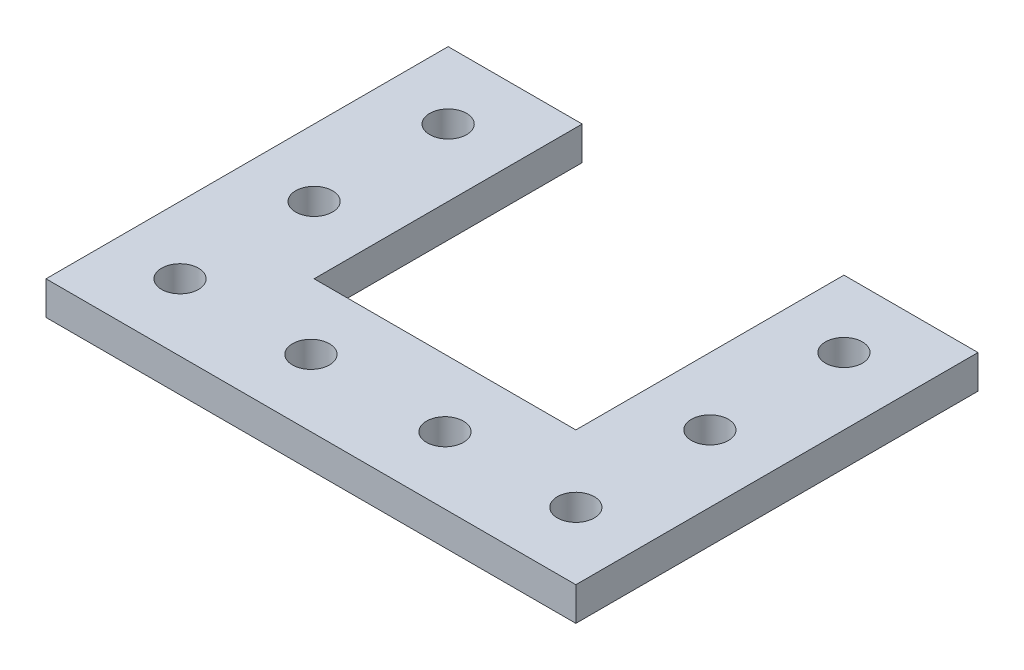
ISO-10303-21;
HEADER;
FILE_DESCRIPTION(('STEP AP214'),'2;1');
FILE_NAME('part.step','',(''),(''),'','','');
FILE_SCHEMA(('AUTOMOTIVE_DESIGN { 1 0 10303 214 1 1 1 1 }'));
ENDSEC;
DATA;
#1=APPLICATION_CONTEXT('core data for automotive mechanical design processes');
#2=APPLICATION_PROTOCOL_DEFINITION('international standard','automotive_design',2000,#1);
#3=PRODUCT_CONTEXT('',#1,'mechanical');
#4=PRODUCT('Part','Part','',(#3));
#5=PRODUCT_RELATED_PRODUCT_CATEGORY('part','',(#4));
#6=PRODUCT_DEFINITION_FORMATION('','',#4);
#7=PRODUCT_DEFINITION_CONTEXT('part definition',#1,'design');
#8=PRODUCT_DEFINITION('design','',#6,#7);
#9=PRODUCT_DEFINITION_SHAPE('','',#8);
#10=(LENGTH_UNIT() NAMED_UNIT(*) SI_UNIT(.MILLI.,.METRE.));
#11=(NAMED_UNIT(*) PLANE_ANGLE_UNIT() SI_UNIT($,.RADIAN.));
#12=(NAMED_UNIT(*) SI_UNIT($,.STERADIAN.) SOLID_ANGLE_UNIT());
#13=UNCERTAINTY_MEASURE_WITH_UNIT(LENGTH_MEASURE(1.E-05),#10,'distance_accuracy_value','');
#14=(GEOMETRIC_REPRESENTATION_CONTEXT(3) GLOBAL_UNCERTAINTY_ASSIGNED_CONTEXT((#13)) GLOBAL_UNIT_ASSIGNED_CONTEXT((#10,
#11,#12)) REPRESENTATION_CONTEXT('',''));
#15=CARTESIAN_POINT('',(0.,0.,0.));
#16=DIRECTION('',(0.,0.,1.));
#17=DIRECTION('',(1.,0.,0.));
#18=AXIS2_PLACEMENT_3D('',#15,#16,#17);
#19=CARTESIAN_POINT('',(0.,6.35,-25.4));
#20=DIRECTION('',(0.,0.,-1.));
#21=DIRECTION('',(-1.,0.,0.));
#22=AXIS2_PLACEMENT_3D('',#19,#20,#21);
#23=PLANE('',#22);
#24=DIRECTION('',(1.,0.,0.));
#25=VECTOR('',#24,1.);
#26=CARTESIAN_POINT('',(0.,0.,-25.4));
#27=LINE('',#26,#25);
#28=CARTESIAN_POINT('',(25.4,0.,-25.4));
#29=VERTEX_POINT('',#28);
#30=CARTESIAN_POINT('',(75.,0.,-25.4));
#31=VERTEX_POINT('',#30);
#32=EDGE_CURVE('E130',#29,#31,#27,.T.);
#33=ORIENTED_EDGE('',*,*,#32,.F.);
#34=DIRECTION('',(0.,-1.,0.));
#35=VECTOR('',#34,1.);
#36=CARTESIAN_POINT('',(25.4,6.35,-25.4));
#37=LINE('',#36,#35);
#38=CARTESIAN_POINT('',(25.4,6.35,-25.4));
#39=VERTEX_POINT('',#38);
#40=EDGE_CURVE('E11',#39,#29,#37,.T.);
#41=ORIENTED_EDGE('',*,*,#40,.F.);
#42=DIRECTION('',(1.,0.,0.));
#43=VECTOR('',#42,1.);
#44=CARTESIAN_POINT('',(0.,6.35,-25.4));
#45=LINE('',#44,#43);
#46=CARTESIAN_POINT('',(75.,6.35,-25.4));
#47=VERTEX_POINT('',#46);
#48=EDGE_CURVE('E149',#39,#47,#45,.T.);
#49=ORIENTED_EDGE('',*,*,#48,.T.);
#50=DIRECTION('',(0.,-1.,0.));
#51=VECTOR('',#50,1.);
#52=CARTESIAN_POINT('',(75.,6.35,-25.4));
#53=LINE('',#52,#51);
#54=EDGE_CURVE('E52',#47,#31,#53,.T.);
#55=ORIENTED_EDGE('',*,*,#54,.T.);
#56=EDGE_LOOP('',(#33,#41,#49,#55));
#57=FACE_BOUND('',#56,.T.);
#58=ADVANCED_FACE('F36',(#57),#23,.T.);
#59=CARTESIAN_POINT('',(25.4,6.35,0.));
#60=DIRECTION('',(-1.,0.,0.));
#61=DIRECTION('',(0.,0.,1.));
#62=AXIS2_PLACEMENT_3D('',#59,#60,#61);
#63=PLANE('',#62);
#64=DIRECTION('',(0.,0.,-1.));
#65=VECTOR('',#64,1.);
#66=CARTESIAN_POINT('',(25.4,0.,0.));
#67=LINE('',#66,#65);
#68=CARTESIAN_POINT('',(25.4,0.,-76.2));
#69=VERTEX_POINT('',#68);
#70=EDGE_CURVE('E132',#29,#69,#67,.T.);
#71=ORIENTED_EDGE('',*,*,#70,.T.);
#72=DIRECTION('',(0.,-1.,0.));
#73=VECTOR('',#72,1.);
#74=CARTESIAN_POINT('',(25.4,6.35,-76.2));
#75=LINE('',#74,#73);
#76=CARTESIAN_POINT('',(25.4,6.35,-76.2));
#77=VERTEX_POINT('',#76);
#78=EDGE_CURVE('E44',#77,#69,#75,.T.);
#79=ORIENTED_EDGE('',*,*,#78,.F.);
#80=DIRECTION('',(0.,0.,-1.));
#81=VECTOR('',#80,1.);
#82=CARTESIAN_POINT('',(25.4,6.35,0.));
#83=LINE('',#82,#81);
#84=EDGE_CURVE('E181',#39,#77,#83,.T.);
#85=ORIENTED_EDGE('',*,*,#84,.F.);
#86=ORIENTED_EDGE('',*,*,#40,.T.);
#87=EDGE_LOOP('',(#71,#79,#85,#86));
#88=FACE_BOUND('',#87,.T.);
#89=ADVANCED_FACE('F166',(#88),#63,.F.);
#90=CARTESIAN_POINT('',(0.,6.35,-76.2));
#91=DIRECTION('',(0.,0.,-1.));
#92=DIRECTION('',(-1.,0.,0.));
#93=AXIS2_PLACEMENT_3D('',#90,#91,#92);
#94=PLANE('',#93);
#95=DIRECTION('',(1.,0.,0.));
#96=VECTOR('',#95,1.);
#97=CARTESIAN_POINT('',(0.,0.,-76.2));
#98=LINE('',#97,#96);
#99=CARTESIAN_POINT('',(0.,0.,-76.2));
#100=VERTEX_POINT('',#99);
#101=EDGE_CURVE('E136',#100,#69,#98,.T.);
#102=ORIENTED_EDGE('',*,*,#101,.F.);
#103=DIRECTION('',(0.,-1.,0.));
#104=VECTOR('',#103,1.);
#105=CARTESIAN_POINT('',(0.,6.35,-76.2));
#106=LINE('',#105,#104);
#107=CARTESIAN_POINT('',(0.,6.35,-76.2));
#108=VERTEX_POINT('',#107);
#109=EDGE_CURVE('E156',#108,#100,#106,.T.);
#110=ORIENTED_EDGE('',*,*,#109,.F.);
#111=DIRECTION('',(1.,0.,0.));
#112=VECTOR('',#111,1.);
#113=CARTESIAN_POINT('',(0.,6.35,-76.2));
#114=LINE('',#113,#112);
#115=EDGE_CURVE('E163',#108,#77,#114,.T.);
#116=ORIENTED_EDGE('',*,*,#115,.T.);
#117=ORIENTED_EDGE('',*,*,#78,.T.);
#118=EDGE_LOOP('',(#102,#110,#116,#117));
#119=FACE_BOUND('',#118,.T.);
#120=ADVANCED_FACE('F161',(#119),#94,.T.);
#121=CARTESIAN_POINT('',(0.,6.35,0.));
#122=DIRECTION('',(1.,0.,0.));
#123=DIRECTION('',(0.,0.,-1.));
#124=AXIS2_PLACEMENT_3D('',#121,#122,#123);
#125=PLANE('',#124);
#126=DIRECTION('',(0.,0.,1.));
#127=VECTOR('',#126,1.);
#128=CARTESIAN_POINT('',(0.,0.,0.));
#129=LINE('',#128,#127);
#130=CARTESIAN_POINT('',(0.,0.,0.));
#131=VERTEX_POINT('',#130);
#132=EDGE_CURVE('E139',#100,#131,#129,.T.);
#133=ORIENTED_EDGE('',*,*,#132,.T.);
#134=DIRECTION('',(0.,-1.,0.));
#135=VECTOR('',#134,1.);
#136=CARTESIAN_POINT('',(0.,6.35,0.));
#137=LINE('',#136,#135);
#138=CARTESIAN_POINT('',(0.,6.35,0.));
#139=VERTEX_POINT('',#138);
#140=EDGE_CURVE('E153',#139,#131,#137,.T.);
#141=ORIENTED_EDGE('',*,*,#140,.F.);
#142=DIRECTION('',(0.,0.,1.));
#143=VECTOR('',#142,1.);
#144=CARTESIAN_POINT('',(0.,6.35,0.));
#145=LINE('',#144,#143);
#146=EDGE_CURVE('E177',#108,#139,#145,.T.);
#147=ORIENTED_EDGE('',*,*,#146,.F.);
#148=ORIENTED_EDGE('',*,*,#109,.T.);
#149=EDGE_LOOP('',(#133,#141,#147,#148));
#150=FACE_BOUND('',#149,.T.);
#151=ADVANCED_FACE('F173',(#150),#125,.F.);
#152=CARTESIAN_POINT('',(0.,6.35,0.));
#153=DIRECTION('',(0.,0.,-1.));
#154=DIRECTION('',(-1.,0.,0.));
#155=AXIS2_PLACEMENT_3D('',#152,#153,#154);
#156=PLANE('',#155);
#157=DIRECTION('',(1.,0.,0.));
#158=VECTOR('',#157,1.);
#159=CARTESIAN_POINT('',(0.,0.,0.));
#160=LINE('',#159,#158);
#161=CARTESIAN_POINT('',(100.4,0.,0.));
#162=VERTEX_POINT('',#161);
#163=EDGE_CURVE('E141',#131,#162,#160,.T.);
#164=ORIENTED_EDGE('',*,*,#163,.T.);
#165=DIRECTION('',(0.,-1.,0.));
#166=VECTOR('',#165,1.);
#167=CARTESIAN_POINT('',(100.4,6.35,0.));
#168=LINE('',#167,#166);
#169=CARTESIAN_POINT('',(100.4,6.35,0.));
#170=VERTEX_POINT('',#169);
#171=EDGE_CURVE('E122',#170,#162,#168,.T.);
#172=ORIENTED_EDGE('',*,*,#171,.F.);
#173=DIRECTION('',(1.,0.,0.));
#174=VECTOR('',#173,1.);
#175=CARTESIAN_POINT('',(0.,6.35,0.));
#176=LINE('',#175,#174);
#177=EDGE_CURVE('E110',#139,#170,#176,.T.);
#178=ORIENTED_EDGE('',*,*,#177,.F.);
#179=ORIENTED_EDGE('',*,*,#140,.T.);
#180=EDGE_LOOP('',(#164,#172,#178,#179));
#181=FACE_BOUND('',#180,.T.);
#182=ADVANCED_FACE('F176',(#181),#156,.F.);
#183=CARTESIAN_POINT('',(100.4,6.35,0.));
#184=DIRECTION('',(-1.,0.,0.));
#185=DIRECTION('',(0.,0.,1.));
#186=AXIS2_PLACEMENT_3D('',#183,#184,#185);
#187=PLANE('',#186);
#188=DIRECTION('',(0.,0.,-1.));
#189=VECTOR('',#188,1.);
#190=CARTESIAN_POINT('',(100.4,0.,0.));
#191=LINE('',#190,#189);
#192=CARTESIAN_POINT('',(100.4,0.,-76.2));
#193=VERTEX_POINT('',#192);
#194=EDGE_CURVE('E119',#162,#193,#191,.T.);
#195=ORIENTED_EDGE('',*,*,#194,.T.);
#196=DIRECTION('',(0.,-1.,0.));
#197=VECTOR('',#196,1.);
#198=CARTESIAN_POINT('',(100.4,6.35,-76.2));
#199=LINE('',#198,#197);
#200=CARTESIAN_POINT('',(100.4,6.35,-76.2));
#201=VERTEX_POINT('',#200);
#202=EDGE_CURVE('E116',#201,#193,#199,.T.);
#203=ORIENTED_EDGE('',*,*,#202,.F.);
#204=DIRECTION('',(0.,0.,-1.));
#205=VECTOR('',#204,1.);
#206=CARTESIAN_POINT('',(100.4,6.35,0.));
#207=LINE('',#206,#205);
#208=EDGE_CURVE('E102',#170,#201,#207,.T.);
#209=ORIENTED_EDGE('',*,*,#208,.F.);
#210=ORIENTED_EDGE('',*,*,#171,.T.);
#211=EDGE_LOOP('',(#195,#203,#209,#210));
#212=FACE_BOUND('',#211,.T.);
#213=ADVANCED_FACE('F117',(#212),#187,.F.);
#214=CARTESIAN_POINT('',(0.,6.35,-76.2));
#215=DIRECTION('',(0.,0.,1.));
#216=DIRECTION('',(1.,0.,0.));
#217=AXIS2_PLACEMENT_3D('',#214,#215,#216);
#218=PLANE('',#217);
#219=DIRECTION('',(-1.,0.,0.));
#220=VECTOR('',#219,1.);
#221=CARTESIAN_POINT('',(0.,0.,-76.2));
#222=LINE('',#221,#220);
#223=CARTESIAN_POINT('',(75.,0.,-76.2));
#224=VERTEX_POINT('',#223);
#225=EDGE_CURVE('E144',#193,#224,#222,.T.);
#226=ORIENTED_EDGE('',*,*,#225,.T.);
#227=DIRECTION('',(0.,-1.,0.));
#228=VECTOR('',#227,1.);
#229=CARTESIAN_POINT('',(75.,6.35,-76.2));
#230=LINE('',#229,#228);
#231=CARTESIAN_POINT('',(75.,6.35,-76.2));
#232=VERTEX_POINT('',#231);
#233=EDGE_CURVE('E78',#232,#224,#230,.T.);
#234=ORIENTED_EDGE('',*,*,#233,.F.);
#235=DIRECTION('',(-1.,0.,0.));
#236=VECTOR('',#235,1.);
#237=CARTESIAN_POINT('',(0.,6.35,-76.2));
#238=LINE('',#237,#236);
#239=EDGE_CURVE('E108',#201,#232,#238,.T.);
#240=ORIENTED_EDGE('',*,*,#239,.F.);
#241=ORIENTED_EDGE('',*,*,#202,.T.);
#242=EDGE_LOOP('',(#226,#234,#240,#241));
#243=FACE_BOUND('',#242,.T.);
#244=ADVANCED_FACE('F124',(#243),#218,.F.);
#245=CARTESIAN_POINT('',(75.,6.35,0.));
#246=DIRECTION('',(-1.,0.,0.));
#247=DIRECTION('',(0.,0.,1.));
#248=AXIS2_PLACEMENT_3D('',#245,#246,#247);
#249=PLANE('',#248);
#250=DIRECTION('',(0.,0.,-1.));
#251=VECTOR('',#250,1.);
#252=CARTESIAN_POINT('',(75.,0.,0.));
#253=LINE('',#252,#251);
#254=EDGE_CURVE('E146',#31,#224,#253,.T.);
#255=ORIENTED_EDGE('',*,*,#254,.F.);
#256=ORIENTED_EDGE('',*,*,#54,.F.);
#257=DIRECTION('',(0.,0.,-1.));
#258=VECTOR('',#257,1.);
#259=CARTESIAN_POINT('',(75.,6.35,0.));
#260=LINE('',#259,#258);
#261=EDGE_CURVE('E125',#47,#232,#260,.T.);
#262=ORIENTED_EDGE('',*,*,#261,.T.);
#263=ORIENTED_EDGE('',*,*,#233,.T.);
#264=EDGE_LOOP('',(#255,#256,#262,#263));
#265=FACE_BOUND('',#264,.T.);
#266=ADVANCED_FACE('F244',(#265),#249,.T.);
#267=CARTESIAN_POINT('',(0.,6.35,0.));
#268=DIRECTION('',(0.,1.,0.));
#269=DIRECTION('',(0.,0.,1.));
#270=AXIS2_PLACEMENT_3D('',#267,#268,#269);
#271=PLANE('',#270);
#272=CARTESIAN_POINT('',(87.7,6.35,-12.7));
#273=DIRECTION('',(0.,1.,0.));
#274=DIRECTION('',(0.,0.,-1.));
#275=AXIS2_PLACEMENT_3D('',#272,#273,#274);
#276=CIRCLE('',#275,3.49999999999998);
#277=CARTESIAN_POINT('',(87.7,6.35,-16.2));
#278=VERTEX_POINT('',#277);
#279=EDGE_CURVE('E197',#278,#278,#276,.T.);
#280=ORIENTED_EDGE('',*,*,#279,.F.);
#281=EDGE_LOOP('',(#280));
#282=FACE_BOUND('',#281,.T.);
#283=CARTESIAN_POINT('',(37.5,6.35,-12.7));
#284=DIRECTION('',(0.,1.,0.));
#285=DIRECTION('',(0.,0.,1.));
#286=AXIS2_PLACEMENT_3D('',#283,#284,#285);
#287=CIRCLE('',#286,3.5);
#288=CARTESIAN_POINT('',(37.5,6.35,-9.2));
#289=VERTEX_POINT('',#288);
#290=EDGE_CURVE('E190',#289,#289,#287,.T.);
#291=ORIENTED_EDGE('',*,*,#290,.F.);
#292=EDGE_LOOP('',(#291));
#293=FACE_BOUND('',#292,.T.);
#294=CARTESIAN_POINT('',(62.9,6.35,-12.7));
#295=DIRECTION('',(0.,1.,0.));
#296=DIRECTION('',(0.,0.,1.));
#297=AXIS2_PLACEMENT_3D('',#294,#295,#296);
#298=CIRCLE('',#297,3.50000000000001);
#299=CARTESIAN_POINT('',(62.9,6.35,-9.19999999999999));
#300=VERTEX_POINT('',#299);
#301=EDGE_CURVE('E204',#300,#300,#298,.T.);
#302=ORIENTED_EDGE('',*,*,#301,.F.);
#303=EDGE_LOOP('',(#302));
#304=FACE_BOUND('',#303,.T.);
#305=CARTESIAN_POINT('',(87.7,6.35,-38.1));
#306=DIRECTION('',(0.,1.,0.));
#307=DIRECTION('',(0.,0.,-1.));
#308=AXIS2_PLACEMENT_3D('',#305,#306,#307);
#309=CIRCLE('',#308,3.50000000000001);
#310=CARTESIAN_POINT('',(87.7,6.35,-41.6));
#311=VERTEX_POINT('',#310);
#312=EDGE_CURVE('E203',#311,#311,#309,.T.);
#313=ORIENTED_EDGE('',*,*,#312,.F.);
#314=EDGE_LOOP('',(#313));
#315=FACE_BOUND('',#314,.T.);
#316=CARTESIAN_POINT('',(87.7,6.35,-63.5));
#317=DIRECTION('',(0.,1.,0.));
#318=DIRECTION('',(0.,0.,-1.));
#319=AXIS2_PLACEMENT_3D('',#316,#317,#318);
#320=CIRCLE('',#319,3.49999999999999);
#321=CARTESIAN_POINT('',(87.7,6.35,-67.));
#322=VERTEX_POINT('',#321);
#323=EDGE_CURVE('E214',#322,#322,#320,.T.);
#324=ORIENTED_EDGE('',*,*,#323,.F.);
#325=EDGE_LOOP('',(#324));
#326=FACE_BOUND('',#325,.T.);
#327=CARTESIAN_POINT('',(12.7,6.35,-63.5));
#328=DIRECTION('',(0.,1.,0.));
#329=DIRECTION('',(0.,0.,1.));
#330=AXIS2_PLACEMENT_3D('',#327,#328,#329);
#331=CIRCLE('',#330,3.5);
#332=CARTESIAN_POINT('',(12.7,6.35,-60.));
#333=VERTEX_POINT('',#332);
#334=EDGE_CURVE('E220',#333,#333,#331,.T.);
#335=ORIENTED_EDGE('',*,*,#334,.F.);
#336=EDGE_LOOP('',(#335));
#337=FACE_BOUND('',#336,.T.);
#338=CARTESIAN_POINT('',(12.7,6.35,-38.1));
#339=DIRECTION('',(0.,1.,0.));
#340=DIRECTION('',(0.,0.,1.));
#341=AXIS2_PLACEMENT_3D('',#338,#339,#340);
#342=CIRCLE('',#341,3.5);
#343=CARTESIAN_POINT('',(12.7,6.35,-34.6));
#344=VERTEX_POINT('',#343);
#345=EDGE_CURVE('E226',#344,#344,#342,.T.);
#346=ORIENTED_EDGE('',*,*,#345,.F.);
#347=EDGE_LOOP('',(#346));
#348=FACE_BOUND('',#347,.T.);
#349=CARTESIAN_POINT('',(12.7,6.35,-12.7));
#350=DIRECTION('',(0.,1.,0.));
#351=DIRECTION('',(0.,0.,1.));
#352=AXIS2_PLACEMENT_3D('',#349,#350,#351);
#353=CIRCLE('',#352,3.5);
#354=CARTESIAN_POINT('',(12.7,6.35,-9.2));
#355=VERTEX_POINT('',#354);
#356=EDGE_CURVE('E184',#355,#355,#353,.T.);
#357=ORIENTED_EDGE('',*,*,#356,.F.);
#358=EDGE_LOOP('',(#357));
#359=FACE_BOUND('',#358,.T.);
#360=ORIENTED_EDGE('',*,*,#48,.F.);
#361=ORIENTED_EDGE('',*,*,#84,.T.);
#362=ORIENTED_EDGE('',*,*,#115,.F.);
#363=ORIENTED_EDGE('',*,*,#146,.T.);
#364=ORIENTED_EDGE('',*,*,#177,.T.);
#365=ORIENTED_EDGE('',*,*,#208,.T.);
#366=ORIENTED_EDGE('',*,*,#239,.T.);
#367=ORIENTED_EDGE('',*,*,#261,.F.);
#368=EDGE_LOOP('',(#360,#361,#362,#363,#364,#365,#366,#367));
#369=FACE_BOUND('',#368,.T.);
#370=ADVANCED_FACE('F105',(#282,#293,#304,#315,#326,#337,#348,#359,#369),#271,.T.);
#371=CARTESIAN_POINT('',(0.,0.,0.));
#372=DIRECTION('',(0.,1.,0.));
#373=DIRECTION('',(0.,0.,1.));
#374=AXIS2_PLACEMENT_3D('',#371,#372,#373);
#375=PLANE('',#374);
#376=CARTESIAN_POINT('',(87.7,0.,-12.7));
#377=DIRECTION('',(0.,1.,0.));
#378=DIRECTION('',(0.,0.,-1.));
#379=AXIS2_PLACEMENT_3D('',#376,#377,#378);
#380=CIRCLE('',#379,3.49999999999998);
#381=CARTESIAN_POINT('',(87.7,0.,-16.2));
#382=VERTEX_POINT('',#381);
#383=EDGE_CURVE('E200',#382,#382,#380,.T.);
#384=ORIENTED_EDGE('',*,*,#383,.T.);
#385=EDGE_LOOP('',(#384));
#386=FACE_BOUND('',#385,.T.);
#387=CARTESIAN_POINT('',(37.5,0.,-12.7));
#388=DIRECTION('',(0.,1.,0.));
#389=DIRECTION('',(0.,0.,1.));
#390=AXIS2_PLACEMENT_3D('',#387,#388,#389);
#391=CIRCLE('',#390,3.5);
#392=CARTESIAN_POINT('',(37.5,0.,-9.2));
#393=VERTEX_POINT('',#392);
#394=EDGE_CURVE('E193',#393,#393,#391,.T.);
#395=ORIENTED_EDGE('',*,*,#394,.T.);
#396=EDGE_LOOP('',(#395));
#397=FACE_BOUND('',#396,.T.);
#398=CARTESIAN_POINT('',(62.9,0.,-12.7));
#399=DIRECTION('',(0.,1.,0.));
#400=DIRECTION('',(0.,0.,1.));
#401=AXIS2_PLACEMENT_3D('',#398,#399,#400);
#402=CIRCLE('',#401,3.50000000000001);
#403=CARTESIAN_POINT('',(62.9,0.,-9.19999999999999));
#404=VERTEX_POINT('',#403);
#405=EDGE_CURVE('E194',#404,#404,#402,.T.);
#406=ORIENTED_EDGE('',*,*,#405,.T.);
#407=EDGE_LOOP('',(#406));
#408=FACE_BOUND('',#407,.T.);
#409=CARTESIAN_POINT('',(87.7,0.,-38.1));
#410=DIRECTION('',(0.,1.,0.));
#411=DIRECTION('',(0.,0.,-1.));
#412=AXIS2_PLACEMENT_3D('',#409,#410,#411);
#413=CIRCLE('',#412,3.50000000000001);
#414=CARTESIAN_POINT('',(87.7,0.,-41.6));
#415=VERTEX_POINT('',#414);
#416=EDGE_CURVE('E211',#415,#415,#413,.T.);
#417=ORIENTED_EDGE('',*,*,#416,.T.);
#418=EDGE_LOOP('',(#417));
#419=FACE_BOUND('',#418,.T.);
#420=CARTESIAN_POINT('',(87.7,0.,-63.5));
#421=DIRECTION('',(0.,1.,0.));
#422=DIRECTION('',(0.,0.,-1.));
#423=AXIS2_PLACEMENT_3D('',#420,#421,#422);
#424=CIRCLE('',#423,3.49999999999999);
#425=CARTESIAN_POINT('',(87.7,0.,-67.));
#426=VERTEX_POINT('',#425);
#427=EDGE_CURVE('E217',#426,#426,#424,.T.);
#428=ORIENTED_EDGE('',*,*,#427,.T.);
#429=EDGE_LOOP('',(#428));
#430=FACE_BOUND('',#429,.T.);
#431=CARTESIAN_POINT('',(12.7,0.,-63.5));
#432=DIRECTION('',(0.,1.,0.));
#433=DIRECTION('',(0.,0.,1.));
#434=AXIS2_PLACEMENT_3D('',#431,#432,#433);
#435=CIRCLE('',#434,3.5);
#436=CARTESIAN_POINT('',(12.7,0.,-60.));
#437=VERTEX_POINT('',#436);
#438=EDGE_CURVE('E223',#437,#437,#435,.T.);
#439=ORIENTED_EDGE('',*,*,#438,.T.);
#440=EDGE_LOOP('',(#439));
#441=FACE_BOUND('',#440,.T.);
#442=CARTESIAN_POINT('',(12.7,0.,-38.1));
#443=DIRECTION('',(0.,1.,0.));
#444=DIRECTION('',(0.,0.,1.));
#445=AXIS2_PLACEMENT_3D('',#442,#443,#444);
#446=CIRCLE('',#445,3.5);
#447=CARTESIAN_POINT('',(12.7,0.,-34.6));
#448=VERTEX_POINT('',#447);
#449=EDGE_CURVE('E187',#448,#448,#446,.T.);
#450=ORIENTED_EDGE('',*,*,#449,.T.);
#451=EDGE_LOOP('',(#450));
#452=FACE_BOUND('',#451,.T.);
#453=CARTESIAN_POINT('',(12.7,0.,-12.7));
#454=DIRECTION('',(0.,1.,0.));
#455=DIRECTION('',(0.,0.,1.));
#456=AXIS2_PLACEMENT_3D('',#453,#454,#455);
#457=CIRCLE('',#456,3.5);
#458=CARTESIAN_POINT('',(12.7,0.,-9.2));
#459=VERTEX_POINT('',#458);
#460=EDGE_CURVE('E133',#459,#459,#457,.T.);
#461=ORIENTED_EDGE('',*,*,#460,.T.);
#462=EDGE_LOOP('',(#461));
#463=FACE_BOUND('',#462,.T.);
#464=ORIENTED_EDGE('',*,*,#32,.T.);
#465=ORIENTED_EDGE('',*,*,#254,.T.);
#466=ORIENTED_EDGE('',*,*,#225,.F.);
#467=ORIENTED_EDGE('',*,*,#194,.F.);
#468=ORIENTED_EDGE('',*,*,#163,.F.);
#469=ORIENTED_EDGE('',*,*,#132,.F.);
#470=ORIENTED_EDGE('',*,*,#101,.T.);
#471=ORIENTED_EDGE('',*,*,#70,.F.);
#472=EDGE_LOOP('',(#464,#465,#466,#467,#468,#469,#470,#471));
#473=FACE_BOUND('',#472,.T.);
#474=ADVANCED_FACE('F169',(#386,#397,#408,#419,#430,#441,#452,#463,#473),#375,.F.);
#475=CARTESIAN_POINT('',(12.7,0.,-12.7));
#476=DIRECTION('',(0.,1.,0.));
#477=DIRECTION('',(0.,0.,1.));
#478=AXIS2_PLACEMENT_3D('',#475,#476,#477);
#479=CYLINDRICAL_SURFACE('',#478,3.5);
#480=ORIENTED_EDGE('',*,*,#460,.F.);
#481=EDGE_LOOP('',(#480));
#482=FACE_BOUND('',#481,.T.);
#483=ORIENTED_EDGE('',*,*,#356,.T.);
#484=EDGE_LOOP('',(#483));
#485=FACE_BOUND('',#484,.T.);
#486=ADVANCED_FACE('F238',(#482,#485),#479,.F.);
#487=CARTESIAN_POINT('',(12.7,0.,-38.1));
#488=DIRECTION('',(0.,1.,0.));
#489=DIRECTION('',(0.,0.,1.));
#490=AXIS2_PLACEMENT_3D('',#487,#488,#489);
#491=CYLINDRICAL_SURFACE('',#490,3.5);
#492=ORIENTED_EDGE('',*,*,#449,.F.);
#493=EDGE_LOOP('',(#492));
#494=FACE_BOUND('',#493,.T.);
#495=ORIENTED_EDGE('',*,*,#345,.T.);
#496=EDGE_LOOP('',(#495));
#497=FACE_BOUND('',#496,.T.);
#498=ADVANCED_FACE('F234',(#494,#497),#491,.F.);
#499=CARTESIAN_POINT('',(12.7,0.,-63.5));
#500=DIRECTION('',(0.,1.,0.));
#501=DIRECTION('',(0.,0.,1.));
#502=AXIS2_PLACEMENT_3D('',#499,#500,#501);
#503=CYLINDRICAL_SURFACE('',#502,3.5);
#504=ORIENTED_EDGE('',*,*,#438,.F.);
#505=EDGE_LOOP('',(#504));
#506=FACE_BOUND('',#505,.T.);
#507=ORIENTED_EDGE('',*,*,#334,.T.);
#508=EDGE_LOOP('',(#507));
#509=FACE_BOUND('',#508,.T.);
#510=ADVANCED_FACE('F237',(#506,#509),#503,.F.);
#511=CARTESIAN_POINT('',(87.7,0.,-63.5));
#512=DIRECTION('',(0.,1.,0.));
#513=DIRECTION('',(0.,0.,1.));
#514=AXIS2_PLACEMENT_3D('',#511,#512,#513);
#515=CYLINDRICAL_SURFACE('',#514,3.49999999999999);
#516=ORIENTED_EDGE('',*,*,#427,.F.);
#517=EDGE_LOOP('',(#516));
#518=FACE_BOUND('',#517,.T.);
#519=ORIENTED_EDGE('',*,*,#323,.T.);
#520=EDGE_LOOP('',(#519));
#521=FACE_BOUND('',#520,.T.);
#522=ADVANCED_FACE('F334',(#518,#521),#515,.F.);
#523=CARTESIAN_POINT('',(87.7,0.,-38.1));
#524=DIRECTION('',(0.,1.,0.));
#525=DIRECTION('',(0.,0.,1.));
#526=AXIS2_PLACEMENT_3D('',#523,#524,#525);
#527=CYLINDRICAL_SURFACE('',#526,3.50000000000001);
#528=ORIENTED_EDGE('',*,*,#416,.F.);
#529=EDGE_LOOP('',(#528));
#530=FACE_BOUND('',#529,.T.);
#531=ORIENTED_EDGE('',*,*,#312,.T.);
#532=EDGE_LOOP('',(#531));
#533=FACE_BOUND('',#532,.T.);
#534=ADVANCED_FACE('F344',(#530,#533),#527,.F.);
#535=CARTESIAN_POINT('',(62.9,0.,-12.7));
#536=DIRECTION('',(0.,1.,0.));
#537=DIRECTION('',(0.,0.,1.));
#538=AXIS2_PLACEMENT_3D('',#535,#536,#537);
#539=CYLINDRICAL_SURFACE('',#538,3.50000000000001);
#540=ORIENTED_EDGE('',*,*,#405,.F.);
#541=EDGE_LOOP('',(#540));
#542=FACE_BOUND('',#541,.T.);
#543=ORIENTED_EDGE('',*,*,#301,.T.);
#544=EDGE_LOOP('',(#543));
#545=FACE_BOUND('',#544,.T.);
#546=ADVANCED_FACE('F354',(#542,#545),#539,.F.);
#547=CARTESIAN_POINT('',(37.5,0.,-12.7));
#548=DIRECTION('',(0.,1.,0.));
#549=DIRECTION('',(0.,0.,1.));
#550=AXIS2_PLACEMENT_3D('',#547,#548,#549);
#551=CYLINDRICAL_SURFACE('',#550,3.5);
#552=ORIENTED_EDGE('',*,*,#394,.F.);
#553=EDGE_LOOP('',(#552));
#554=FACE_BOUND('',#553,.T.);
#555=ORIENTED_EDGE('',*,*,#290,.T.);
#556=EDGE_LOOP('',(#555));
#557=FACE_BOUND('',#556,.T.);
#558=ADVANCED_FACE('F364',(#554,#557),#551,.F.);
#559=CARTESIAN_POINT('',(87.7,0.,-12.7));
#560=DIRECTION('',(0.,1.,0.));
#561=DIRECTION('',(0.,0.,1.));
#562=AXIS2_PLACEMENT_3D('',#559,#560,#561);
#563=CYLINDRICAL_SURFACE('',#562,3.49999999999998);
#564=ORIENTED_EDGE('',*,*,#383,.F.);
#565=EDGE_LOOP('',(#564));
#566=FACE_BOUND('',#565,.T.);
#567=ORIENTED_EDGE('',*,*,#279,.T.);
#568=EDGE_LOOP('',(#567));
#569=FACE_BOUND('',#568,.T.);
#570=ADVANCED_FACE('F374',(#566,#569),#563,.F.);
#571=CLOSED_SHELL('',(#58,#89,#120,#151,#182,#213,#244,#266,#370,#474,#486,#498,#510,#522,#534,
#546,#558,#570));
#572=MANIFOLD_SOLID_BREP('B2',#571);
#573=ADVANCED_BREP_SHAPE_REPRESENTATION('',(#18,#572),#14);
#574=SHAPE_DEFINITION_REPRESENTATION(#9,#573);
ENDSEC;
END-ISO-10303-21;
